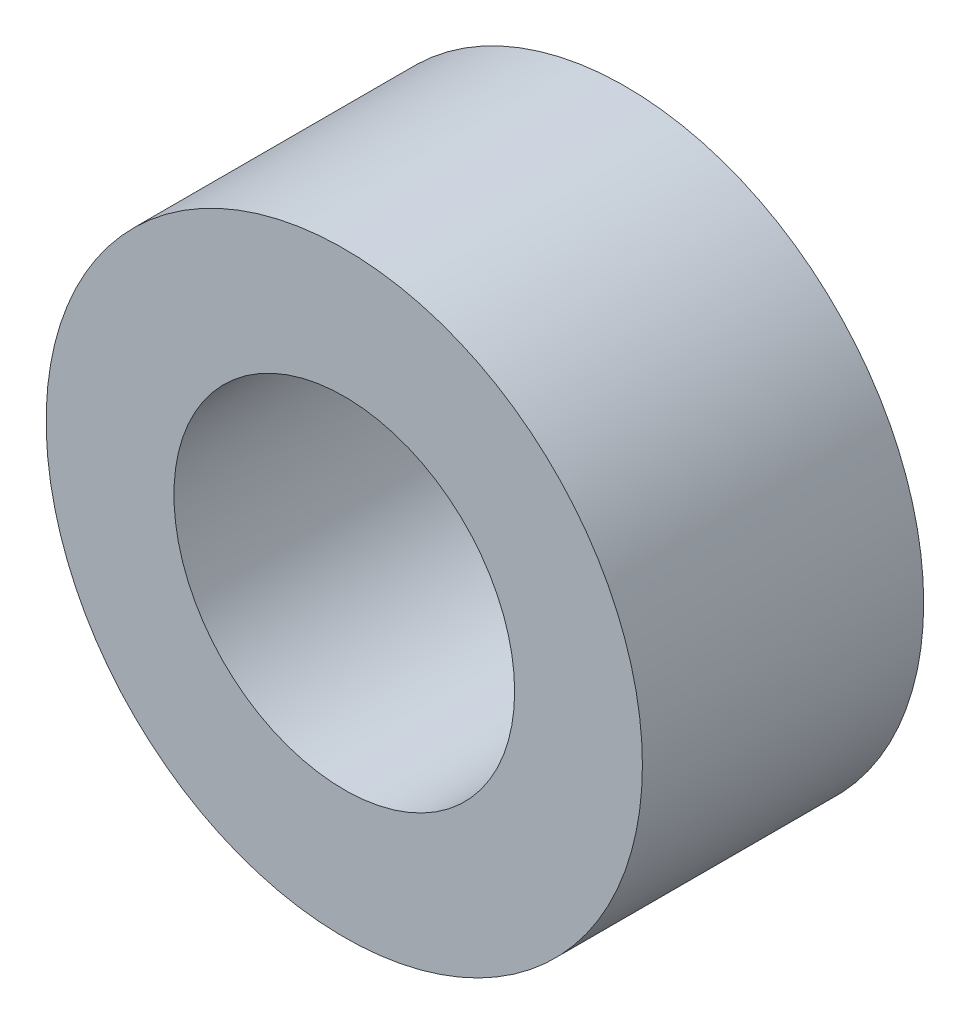
ISO-10303-21;
HEADER;
FILE_DESCRIPTION(('STEP AP214'),'2;1');
FILE_NAME('part.step','',(''),(''),'','','');
FILE_SCHEMA(('AUTOMOTIVE_DESIGN { 1 0 10303 214 1 1 1 1 }'));
ENDSEC;
DATA;
#1=APPLICATION_CONTEXT('core data for automotive mechanical design processes');
#2=APPLICATION_PROTOCOL_DEFINITION('international standard','automotive_design',2000,#1);
#3=PRODUCT_CONTEXT('',#1,'mechanical');
#4=PRODUCT('Part','Part','',(#3));
#5=PRODUCT_RELATED_PRODUCT_CATEGORY('part','',(#4));
#6=PRODUCT_DEFINITION_FORMATION('','',#4);
#7=PRODUCT_DEFINITION_CONTEXT('part definition',#1,'design');
#8=PRODUCT_DEFINITION('design','',#6,#7);
#9=PRODUCT_DEFINITION_SHAPE('','',#8);
#10=(LENGTH_UNIT() NAMED_UNIT(*) SI_UNIT(.MILLI.,.METRE.));
#11=(NAMED_UNIT(*) PLANE_ANGLE_UNIT() SI_UNIT($,.RADIAN.));
#12=(NAMED_UNIT(*) SI_UNIT($,.STERADIAN.) SOLID_ANGLE_UNIT());
#13=UNCERTAINTY_MEASURE_WITH_UNIT(LENGTH_MEASURE(1.E-05),#10,'distance_accuracy_value','');
#14=(GEOMETRIC_REPRESENTATION_CONTEXT(3) GLOBAL_UNCERTAINTY_ASSIGNED_CONTEXT((#13)) GLOBAL_UNIT_ASSIGNED_CONTEXT((#10,
#11,#12)) REPRESENTATION_CONTEXT('',''));
#15=CARTESIAN_POINT('',(0.,0.,0.));
#16=DIRECTION('',(0.,0.,1.));
#17=DIRECTION('',(1.,0.,0.));
#18=AXIS2_PLACEMENT_3D('',#15,#16,#17);
#19=CARTESIAN_POINT('',(0.,0.,9.906));
#20=DIRECTION('',(0.,0.,1.));
#21=DIRECTION('',(1.,0.,0.));
#22=AXIS2_PLACEMENT_3D('',#19,#20,#21);
#23=PLANE('',#22);
#24=CARTESIAN_POINT('',(0.,0.,9.906));
#25=DIRECTION('',(0.,0.,1.));
#26=DIRECTION('',(1.,0.,0.));
#27=AXIS2_PLACEMENT_3D('',#24,#25,#26);
#28=CIRCLE('',#27,10.5);
#29=CARTESIAN_POINT('',(10.5,0.,9.906));
#30=VERTEX_POINT('',#29);
#31=EDGE_CURVE('E11',#30,#30,#28,.T.);
#32=ORIENTED_EDGE('',*,*,#31,.T.);
#33=EDGE_LOOP('',(#32));
#34=FACE_BOUND('',#33,.T.);
#35=CARTESIAN_POINT('',(0.,0.,9.906));
#36=DIRECTION('',(0.,0.,1.));
#37=DIRECTION('',(1.,0.,0.));
#38=AXIS2_PLACEMENT_3D('',#35,#36,#37);
#39=CIRCLE('',#38,6.);
#40=CARTESIAN_POINT('',(6.,0.,9.906));
#41=VERTEX_POINT('',#40);
#42=EDGE_CURVE('E58',#41,#41,#39,.T.);
#43=ORIENTED_EDGE('',*,*,#42,.F.);
#44=EDGE_LOOP('',(#43));
#45=FACE_BOUND('',#44,.T.);
#46=ADVANCED_FACE('F45',(#34,#45),#23,.T.);
#47=CARTESIAN_POINT('',(0.,0.,0.));
#48=DIRECTION('',(0.,0.,1.));
#49=DIRECTION('',(1.,0.,0.));
#50=AXIS2_PLACEMENT_3D('',#47,#48,#49);
#51=PLANE('',#50);
#52=CARTESIAN_POINT('',(0.,0.,0.));
#53=DIRECTION('',(0.,0.,1.));
#54=DIRECTION('',(1.,0.,0.));
#55=AXIS2_PLACEMENT_3D('',#52,#53,#54);
#56=CIRCLE('',#55,10.5);
#57=CARTESIAN_POINT('',(10.5,0.,0.));
#58=VERTEX_POINT('',#57);
#59=EDGE_CURVE('E49',#58,#58,#56,.T.);
#60=ORIENTED_EDGE('',*,*,#59,.F.);
#61=EDGE_LOOP('',(#60));
#62=FACE_BOUND('',#61,.T.);
#63=CARTESIAN_POINT('',(0.,0.,0.));
#64=DIRECTION('',(0.,0.,1.));
#65=DIRECTION('',(1.,0.,0.));
#66=AXIS2_PLACEMENT_3D('',#63,#64,#65);
#67=CIRCLE('',#66,6.);
#68=CARTESIAN_POINT('',(6.,0.,0.));
#69=VERTEX_POINT('',#68);
#70=EDGE_CURVE('E60',#69,#69,#67,.T.);
#71=ORIENTED_EDGE('',*,*,#70,.T.);
#72=EDGE_LOOP('',(#71));
#73=FACE_BOUND('',#72,.T.);
#74=ADVANCED_FACE('F72',(#62,#73),#51,.F.);
#75=CARTESIAN_POINT('',(0.,0.,9.906));
#76=DIRECTION('',(0.,0.,-1.));
#77=DIRECTION('',(-1.,0.,0.));
#78=AXIS2_PLACEMENT_3D('',#75,#76,#77);
#79=CYLINDRICAL_SURFACE('',#78,10.5);
#80=ORIENTED_EDGE('',*,*,#31,.F.);
#81=EDGE_LOOP('',(#80));
#82=FACE_BOUND('',#81,.T.);
#83=ORIENTED_EDGE('',*,*,#59,.T.);
#84=EDGE_LOOP('',(#83));
#85=FACE_BOUND('',#84,.T.);
#86=ADVANCED_FACE('F47',(#82,#85),#79,.T.);
#87=CARTESIAN_POINT('',(0.,0.,9.906));
#88=DIRECTION('',(0.,0.,-1.));
#89=DIRECTION('',(-1.,0.,0.));
#90=AXIS2_PLACEMENT_3D('',#87,#88,#89);
#91=CYLINDRICAL_SURFACE('',#90,6.);
#92=ORIENTED_EDGE('',*,*,#42,.T.);
#93=EDGE_LOOP('',(#92));
#94=FACE_BOUND('',#93,.T.);
#95=ORIENTED_EDGE('',*,*,#70,.F.);
#96=EDGE_LOOP('',(#95));
#97=FACE_BOUND('',#96,.T.);
#98=ADVANCED_FACE('F68',(#94,#97),#91,.F.);
#99=CLOSED_SHELL('',(#46,#74,#86,#98));
#100=MANIFOLD_SOLID_BREP('B2',#99);
#101=ADVANCED_BREP_SHAPE_REPRESENTATION('',(#18,#100),#14);
#102=SHAPE_DEFINITION_REPRESENTATION(#9,#101);
ENDSEC;
END-ISO-10303-21;
